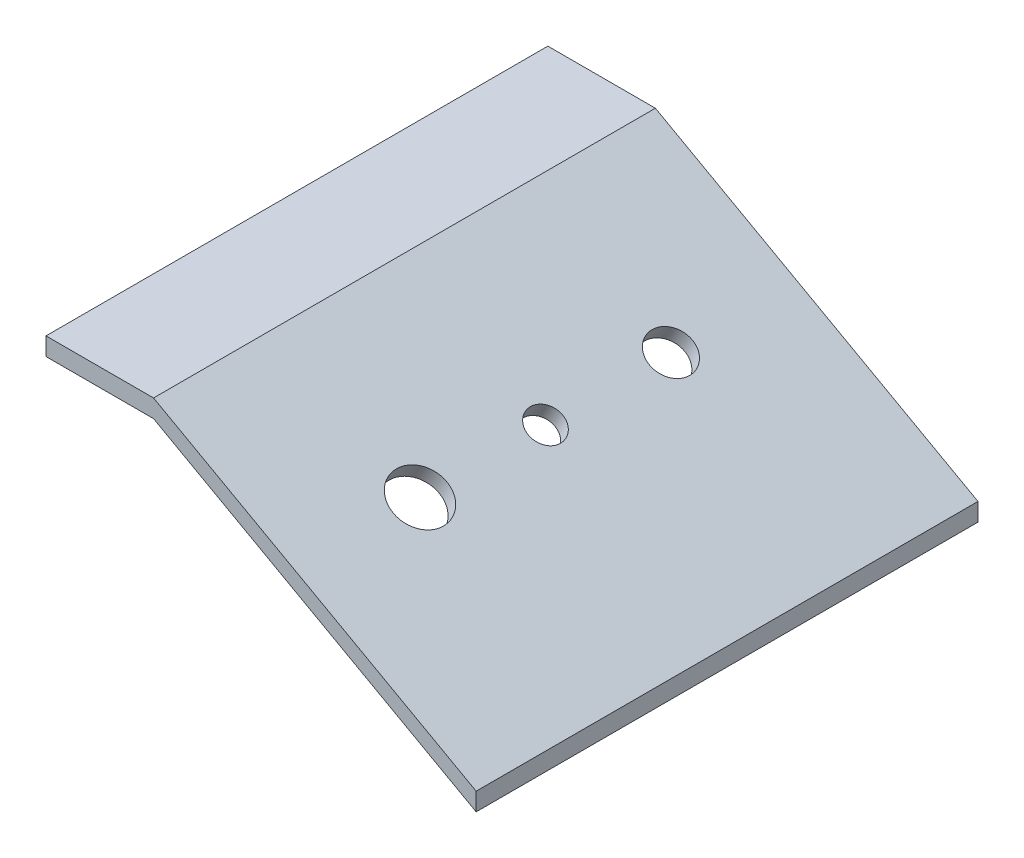
ISO-10303-21;
HEADER;
FILE_DESCRIPTION(('STEP AP214'),'2;1');
FILE_NAME('part.step','',(''),(''),'','','');
FILE_SCHEMA(('AUTOMOTIVE_DESIGN { 1 0 10303 214 1 1 1 1 }'));
ENDSEC;
DATA;
#1=APPLICATION_CONTEXT('core data for automotive mechanical design processes');
#2=APPLICATION_PROTOCOL_DEFINITION('international standard','automotive_design',2000,#1);
#3=PRODUCT_CONTEXT('',#1,'mechanical');
#4=PRODUCT('Part','Part','',(#3));
#5=PRODUCT_RELATED_PRODUCT_CATEGORY('part','',(#4));
#6=PRODUCT_DEFINITION_FORMATION('','',#4);
#7=PRODUCT_DEFINITION_CONTEXT('part definition',#1,'design');
#8=PRODUCT_DEFINITION('design','',#6,#7);
#9=PRODUCT_DEFINITION_SHAPE('','',#8);
#10=(LENGTH_UNIT() NAMED_UNIT(*) SI_UNIT(.MILLI.,.METRE.));
#11=(NAMED_UNIT(*) PLANE_ANGLE_UNIT() SI_UNIT($,.RADIAN.));
#12=(NAMED_UNIT(*) SI_UNIT($,.STERADIAN.) SOLID_ANGLE_UNIT());
#13=UNCERTAINTY_MEASURE_WITH_UNIT(LENGTH_MEASURE(1.E-05),#10,'distance_accuracy_value','');
#14=(GEOMETRIC_REPRESENTATION_CONTEXT(3) GLOBAL_UNCERTAINTY_ASSIGNED_CONTEXT((#13)) GLOBAL_UNIT_ASSIGNED_CONTEXT((#10,
#11,#12)) REPRESENTATION_CONTEXT('',''));
#15=CARTESIAN_POINT('',(0.,0.,0.));
#16=DIRECTION('',(0.,0.,1.));
#17=DIRECTION('',(1.,0.,0.));
#18=AXIS2_PLACEMENT_3D('',#15,#16,#17);
#19=CARTESIAN_POINT('',(0.,0.,152.4));
#20=DIRECTION('',(1.,0.,0.));
#21=DIRECTION('',(0.,0.,-1.));
#22=AXIS2_PLACEMENT_3D('',#19,#20,#21);
#23=PLANE('',#22);
#24=DIRECTION('',(0.,0.,-1.));
#25=VECTOR('',#24,1.);
#26=CARTESIAN_POINT('',(0.,6.35,152.4));
#27=LINE('',#26,#25);
#28=CARTESIAN_POINT('',(0.,6.35,165.1));
#29=VERTEX_POINT('',#28);
#30=CARTESIAN_POINT('',(0.,6.35,-12.7));
#31=VERTEX_POINT('',#30);
#32=EDGE_CURVE('E54',#29,#31,#27,.T.);
#33=ORIENTED_EDGE('',*,*,#32,.T.);
#34=DIRECTION('',(0.,1.,0.));
#35=VECTOR('',#34,1.);
#36=CARTESIAN_POINT('',(0.,6.35,-12.7));
#37=LINE('',#36,#35);
#38=CARTESIAN_POINT('',(0.,0.,-12.7));
#39=VERTEX_POINT('',#38);
#40=EDGE_CURVE('E84',#39,#31,#37,.T.);
#41=ORIENTED_EDGE('',*,*,#40,.F.);
#42=DIRECTION('',(0.,0.,-1.));
#43=VECTOR('',#42,1.);
#44=CARTESIAN_POINT('',(0.,0.,152.4));
#45=LINE('',#44,#43);
#46=CARTESIAN_POINT('',(0.,0.,165.1));
#47=VERTEX_POINT('',#46);
#48=EDGE_CURVE('E46',#47,#39,#45,.T.);
#49=ORIENTED_EDGE('',*,*,#48,.F.);
#50=DIRECTION('',(0.,-1.,0.));
#51=VECTOR('',#50,1.);
#52=CARTESIAN_POINT('',(0.,0.,165.1));
#53=LINE('',#52,#51);
#54=EDGE_CURVE('E85',#29,#47,#53,.T.);
#55=ORIENTED_EDGE('',*,*,#54,.F.);
#56=EDGE_LOOP('',(#33,#41,#49,#55));
#57=FACE_BOUND('',#56,.T.);
#58=ADVANCED_FACE('F32',(#57),#23,.F.);
#59=CARTESIAN_POINT('',(0.,0.,152.4));
#60=DIRECTION('',(0.,1.,0.));
#61=DIRECTION('',(0.,0.,1.));
#62=AXIS2_PLACEMENT_3D('',#59,#60,#61);
#63=PLANE('',#62);
#64=CARTESIAN_POINT('',(12.7,0.,146.05));
#65=DIRECTION('',(0.,1.,0.));
#66=DIRECTION('',(0.,0.,1.));
#67=AXIS2_PLACEMENT_3D('',#64,#65,#66);
#68=CIRCLE('',#67,3.175);
#69=CARTESIAN_POINT('',(12.7,0.,149.225));
#70=VERTEX_POINT('',#69);
#71=EDGE_CURVE('E166',#70,#70,#68,.F.);
#72=ORIENTED_EDGE('',*,*,#71,.F.);
#73=EDGE_LOOP('',(#72));
#74=FACE_BOUND('',#73,.T.);
#75=CARTESIAN_POINT('',(12.7,0.,6.34999999999999));
#76=DIRECTION('',(0.,1.,0.));
#77=DIRECTION('',(0.,0.,1.));
#78=AXIS2_PLACEMENT_3D('',#75,#76,#77);
#79=CIRCLE('',#78,3.175);
#80=CARTESIAN_POINT('',(12.7,0.,9.525));
#81=VERTEX_POINT('',#80);
#82=EDGE_CURVE('E163',#81,#81,#79,.F.);
#83=ORIENTED_EDGE('',*,*,#82,.F.);
#84=EDGE_LOOP('',(#83));
#85=FACE_BOUND('',#84,.T.);
#86=ORIENTED_EDGE('',*,*,#48,.T.);
#87=DIRECTION('',(-1.,0.,0.));
#88=VECTOR('',#87,1.);
#89=CARTESIAN_POINT('',(0.,0.,-12.7));
#90=LINE('',#89,#88);
#91=CARTESIAN_POINT('',(38.1,0.,-12.7));
#92=VERTEX_POINT('',#91);
#93=EDGE_CURVE('E101',#92,#39,#90,.T.);
#94=ORIENTED_EDGE('',*,*,#93,.F.);
#95=DIRECTION('',(0.,0.,-1.));
#96=VECTOR('',#95,1.);
#97=CARTESIAN_POINT('',(38.1,0.,152.4));
#98=LINE('',#97,#96);
#99=CARTESIAN_POINT('',(38.1,0.,165.1));
#100=VERTEX_POINT('',#99);
#101=EDGE_CURVE('E160',#100,#92,#98,.T.);
#102=ORIENTED_EDGE('',*,*,#101,.F.);
#103=DIRECTION('',(1.,0.,0.));
#104=VECTOR('',#103,1.);
#105=CARTESIAN_POINT('',(38.1,0.,165.1));
#106=LINE('',#105,#104);
#107=EDGE_CURVE('E111',#47,#100,#106,.T.);
#108=ORIENTED_EDGE('',*,*,#107,.F.);
#109=EDGE_LOOP('',(#86,#94,#102,#108));
#110=FACE_BOUND('',#109,.T.);
#111=ADVANCED_FACE('F177',(#74,#85,#110),#63,.F.);
#112=CARTESIAN_POINT('',(38.1,0.,152.4));
#113=DIRECTION('',(0.485642931178632,0.874157276121538,0.));
#114=DIRECTION('',(-0.874157276121538,0.485642931178632,0.));
#115=AXIS2_PLACEMENT_3D('',#112,#113,#114);
#116=PLANE('',#115);
#117=CARTESIAN_POINT('',(141.298202593256,-57.3323347740314,146.05));
#118=DIRECTION('',(0.485642931178632,0.874157276121538,0.));
#119=DIRECTION('',(-0.874157276121538,0.485642931178632,0.));
#120=AXIS2_PLACEMENT_3D('',#117,#118,#119);
#121=CIRCLE('',#120,3.17499999999999);
#122=CARTESIAN_POINT('',(138.522753241571,-55.7904184675392,146.05));
#123=VERTEX_POINT('',#122);
#124=EDGE_CURVE('E11',#123,#123,#121,.F.);
#125=ORIENTED_EDGE('',*,*,#124,.F.);
#126=EDGE_LOOP('',(#125));
#127=FACE_BOUND('',#126,.T.);
#128=CARTESIAN_POINT('',(141.298202593256,-57.3323347740314,6.34999999999999));
#129=DIRECTION('',(0.485642931178632,0.874157276121538,0.));
#130=DIRECTION('',(-0.874157276121538,0.485642931178632,0.));
#131=AXIS2_PLACEMENT_3D('',#128,#129,#130);
#132=CIRCLE('',#131,3.17499999999999);
#133=CARTESIAN_POINT('',(138.522753241571,-55.7904184675392,6.34999999999999));
#134=VERTEX_POINT('',#133);
#135=EDGE_CURVE('E39',#134,#134,#132,.F.);
#136=ORIENTED_EDGE('',*,*,#135,.F.);
#137=EDGE_LOOP('',(#136));
#138=FACE_BOUND('',#137,.T.);
#139=CARTESIAN_POINT('',(85.3623336133648,-26.2568520074249,120.65));
#140=DIRECTION('',(0.485642931178632,0.874157276121538,0.));
#141=DIRECTION('',(-0.874157276121538,0.485642931178632,0.));
#142=AXIS2_PLACEMENT_3D('',#139,#140,#141);
#143=CIRCLE('',#142,9.52500000000001);
#144=CARTESIAN_POINT('',(77.0359855583071,-21.6311030879484,120.65));
#145=VERTEX_POINT('',#144);
#146=EDGE_CURVE('E87',#145,#145,#143,.T.);
#147=ORIENTED_EDGE('',*,*,#146,.T.);
#148=EDGE_LOOP('',(#147));
#149=FACE_BOUND('',#148,.T.);
#150=CARTESIAN_POINT('',(85.3623336133648,-26.2568520074249,76.2));
#151=DIRECTION('',(0.485642931178632,0.874157276121538,0.));
#152=DIRECTION('',(-0.874157276121538,0.485642931178632,0.));
#153=AXIS2_PLACEMENT_3D('',#150,#151,#152);
#154=CIRCLE('',#153,6.09600000000001);
#155=CARTESIAN_POINT('',(80.0334708581279,-23.2963726989599,76.2));
#156=VERTEX_POINT('',#155);
#157=EDGE_CURVE('E150',#156,#156,#154,.T.);
#158=ORIENTED_EDGE('',*,*,#157,.T.);
#159=EDGE_LOOP('',(#158));
#160=FACE_BOUND('',#159,.T.);
#161=CARTESIAN_POINT('',(85.3623336133648,-26.2568520074249,31.75));
#162=DIRECTION('',(0.485642931178632,0.874157276121538,0.));
#163=DIRECTION('',(-0.874157276121538,0.485642931178632,0.));
#164=AXIS2_PLACEMENT_3D('',#161,#162,#163);
#165=CIRCLE('',#164,7.62);
#166=CARTESIAN_POINT('',(78.7012551693187,-22.5562528718437,31.75));
#167=VERTEX_POINT('',#166);
#168=EDGE_CURVE('E142',#167,#167,#165,.T.);
#169=ORIENTED_EDGE('',*,*,#168,.T.);
#170=EDGE_LOOP('',(#169));
#171=FACE_BOUND('',#170,.T.);
#172=ORIENTED_EDGE('',*,*,#101,.T.);
#173=DIRECTION('',(-0.874157276121538,0.485642931178632,0.));
#174=VECTOR('',#173,1.);
#175=CARTESIAN_POINT('',(38.1,0.,-12.7));
#176=LINE('',#175,#174);
#177=CARTESIAN_POINT('',(152.4,-63.5,-12.7));
#178=VERTEX_POINT('',#177);
#179=EDGE_CURVE('E108',#178,#92,#176,.T.);
#180=ORIENTED_EDGE('',*,*,#179,.F.);
#181=DIRECTION('',(0.,0.,-1.));
#182=VECTOR('',#181,1.);
#183=CARTESIAN_POINT('',(152.4,-63.5,152.4));
#184=LINE('',#183,#182);
#185=CARTESIAN_POINT('',(152.4,-63.5,165.1));
#186=VERTEX_POINT('',#185);
#187=EDGE_CURVE('E158',#186,#178,#184,.T.);
#188=ORIENTED_EDGE('',*,*,#187,.F.);
#189=DIRECTION('',(0.874157276121538,-0.485642931178632,0.));
#190=VECTOR('',#189,1.);
#191=CARTESIAN_POINT('',(152.4,-63.5,165.1));
#192=LINE('',#191,#190);
#193=EDGE_CURVE('E114',#100,#186,#192,.T.);
#194=ORIENTED_EDGE('',*,*,#193,.F.);
#195=EDGE_LOOP('',(#172,#180,#188,#194));
#196=FACE_BOUND('',#195,.T.);
#197=ADVANCED_FACE('F173',(#127,#138,#149,#160,#171,#196),#116,.F.);
#198=CARTESIAN_POINT('',(152.4,-63.5,152.4));
#199=DIRECTION('',(-1.,0.,0.));
#200=DIRECTION('',(0.,0.,1.));
#201=AXIS2_PLACEMENT_3D('',#198,#199,#200);
#202=PLANE('',#201);
#203=ORIENTED_EDGE('',*,*,#187,.T.);
#204=DIRECTION('',(0.,-1.,0.));
#205=VECTOR('',#204,1.);
#206=CARTESIAN_POINT('',(152.4,-63.5,-12.7));
#207=LINE('',#206,#205);
#208=CARTESIAN_POINT('',(152.4,-57.15,-12.7));
#209=VERTEX_POINT('',#208);
#210=EDGE_CURVE('E105',#209,#178,#207,.T.);
#211=ORIENTED_EDGE('',*,*,#210,.F.);
#212=DIRECTION('',(0.,0.,-1.));
#213=VECTOR('',#212,1.);
#214=CARTESIAN_POINT('',(152.4,-57.15,152.4));
#215=LINE('',#214,#213);
#216=CARTESIAN_POINT('',(152.4,-57.15,165.1));
#217=VERTEX_POINT('',#216);
#218=EDGE_CURVE('E156',#217,#209,#215,.T.);
#219=ORIENTED_EDGE('',*,*,#218,.F.);
#220=DIRECTION('',(0.,1.,0.));
#221=VECTOR('',#220,1.);
#222=CARTESIAN_POINT('',(152.4,-57.15,165.1));
#223=LINE('',#222,#221);
#224=EDGE_CURVE('E117',#186,#217,#223,.T.);
#225=ORIENTED_EDGE('',*,*,#224,.F.);
#226=EDGE_LOOP('',(#203,#211,#219,#225));
#227=FACE_BOUND('',#226,.T.);
#228=ADVANCED_FACE('F176',(#227),#202,.F.);
#229=CARTESIAN_POINT('',(152.4,-57.15,152.4));
#230=DIRECTION('',(-0.485642931178632,-0.874157276121538,0.));
#231=DIRECTION('',(0.874157276121538,-0.485642931178632,0.));
#232=AXIS2_PLACEMENT_3D('',#229,#230,#231);
#233=PLANE('',#232);
#234=CARTESIAN_POINT('',(88.0580883303459,-21.4044935168588,120.65));
#235=DIRECTION('',(0.485642931178632,0.874157276121538,0.));
#236=DIRECTION('',(-0.874157276121538,0.485642931178632,0.));
#237=AXIS2_PLACEMENT_3D('',#234,#235,#236);
#238=CIRCLE('',#237,9.52500000000001);
#239=CARTESIAN_POINT('',(79.7317402752882,-16.7787445973823,120.65));
#240=VERTEX_POINT('',#239);
#241=EDGE_CURVE('E139',#240,#240,#238,.T.);
#242=ORIENTED_EDGE('',*,*,#241,.F.);
#243=EDGE_LOOP('',(#242));
#244=FACE_BOUND('',#243,.T.);
#245=CARTESIAN_POINT('',(88.0580883303459,-21.4044935168588,76.2));
#246=DIRECTION('',(0.485642931178632,0.874157276121538,0.));
#247=DIRECTION('',(-0.874157276121538,0.485642931178632,0.));
#248=AXIS2_PLACEMENT_3D('',#245,#246,#247);
#249=CIRCLE('',#248,6.09600000000001);
#250=CARTESIAN_POINT('',(82.729225575109,-18.4440142083939,76.2));
#251=VERTEX_POINT('',#250);
#252=EDGE_CURVE('E143',#251,#251,#249,.T.);
#253=ORIENTED_EDGE('',*,*,#252,.F.);
#254=EDGE_LOOP('',(#253));
#255=FACE_BOUND('',#254,.T.);
#256=CARTESIAN_POINT('',(88.0580883303459,-21.4044935168588,31.75));
#257=DIRECTION('',(0.485642931178632,0.874157276121538,0.));
#258=DIRECTION('',(-0.874157276121538,0.485642931178632,0.));
#259=AXIS2_PLACEMENT_3D('',#256,#257,#258);
#260=CIRCLE('',#259,7.62);
#261=CARTESIAN_POINT('',(81.3970098862998,-17.7038943812776,31.75));
#262=VERTEX_POINT('',#261);
#263=EDGE_CURVE('E138',#262,#262,#260,.T.);
#264=ORIENTED_EDGE('',*,*,#263,.F.);
#265=EDGE_LOOP('',(#264));
#266=FACE_BOUND('',#265,.T.);
#267=ORIENTED_EDGE('',*,*,#218,.T.);
#268=DIRECTION('',(0.874157276121538,-0.485642931178632,0.));
#269=VECTOR('',#268,1.);
#270=CARTESIAN_POINT('',(152.4,-57.15,-12.7));
#271=LINE('',#270,#269);
#272=CARTESIAN_POINT('',(38.1,6.34999999999998,-12.7));
#273=VERTEX_POINT('',#272);
#274=EDGE_CURVE('E95',#273,#209,#271,.T.);
#275=ORIENTED_EDGE('',*,*,#274,.F.);
#276=DIRECTION('',(0.,0.,-1.));
#277=VECTOR('',#276,1.);
#278=CARTESIAN_POINT('',(38.1,6.34999999999998,152.4));
#279=LINE('',#278,#277);
#280=CARTESIAN_POINT('',(38.1,6.34999999999998,165.1));
#281=VERTEX_POINT('',#280);
#282=EDGE_CURVE('E86',#281,#273,#279,.T.);
#283=ORIENTED_EDGE('',*,*,#282,.F.);
#284=DIRECTION('',(-0.874157276121538,0.485642931178632,0.));
#285=VECTOR('',#284,1.);
#286=CARTESIAN_POINT('',(38.1,6.34999999999998,165.1));
#287=LINE('',#286,#285);
#288=EDGE_CURVE('E120',#217,#281,#287,.T.);
#289=ORIENTED_EDGE('',*,*,#288,.F.);
#290=EDGE_LOOP('',(#267,#275,#283,#289));
#291=FACE_BOUND('',#290,.T.);
#292=ADVANCED_FACE('F196',(#244,#255,#266,#291),#233,.F.);
#293=CARTESIAN_POINT('',(0.,6.35,152.4));
#294=DIRECTION('',(0.,-1.,0.));
#295=DIRECTION('',(1.,0.,0.));
#296=AXIS2_PLACEMENT_3D('',#293,#294,#295);
#297=PLANE('',#296);
#298=ORIENTED_EDGE('',*,*,#282,.T.);
#299=DIRECTION('',(1.,0.,0.));
#300=VECTOR('',#299,1.);
#301=CARTESIAN_POINT('',(38.1,6.34999999999998,-12.7));
#302=LINE('',#301,#300);
#303=EDGE_CURVE('E90',#31,#273,#302,.T.);
#304=ORIENTED_EDGE('',*,*,#303,.F.);
#305=ORIENTED_EDGE('',*,*,#32,.F.);
#306=DIRECTION('',(-1.,0.,0.));
#307=VECTOR('',#306,1.);
#308=CARTESIAN_POINT('',(0.,6.35,165.1));
#309=LINE('',#308,#307);
#310=EDGE_CURVE('E123',#281,#29,#309,.T.);
#311=ORIENTED_EDGE('',*,*,#310,.F.);
#312=EDGE_LOOP('',(#298,#304,#305,#311));
#313=FACE_BOUND('',#312,.T.);
#314=ADVANCED_FACE('F91',(#313),#297,.F.);
#315=CARTESIAN_POINT('',(14.0461056187224,-154.626062397781,31.75));
#316=DIRECTION('',(0.485642931178632,0.874157276121538,0.));
#317=DIRECTION('',(-0.874157276121538,0.485642931178632,0.));
#318=AXIS2_PLACEMENT_3D('',#315,#316,#317);
#319=CYLINDRICAL_SURFACE('',#318,7.62);
#320=ORIENTED_EDGE('',*,*,#263,.T.);
#321=EDGE_LOOP('',(#320));
#322=FACE_BOUND('',#321,.T.);
#323=ORIENTED_EDGE('',*,*,#168,.F.);
#324=EDGE_LOOP('',(#323));
#325=FACE_BOUND('',#324,.T.);
#326=ADVANCED_FACE('F237',(#322,#325),#319,.F.);
#327=CARTESIAN_POINT('',(14.0461056187224,-154.626062397781,76.2));
#328=DIRECTION('',(0.485642931178632,0.874157276121538,0.));
#329=DIRECTION('',(-0.874157276121538,0.485642931178632,0.));
#330=AXIS2_PLACEMENT_3D('',#327,#328,#329);
#331=CYLINDRICAL_SURFACE('',#330,6.09600000000001);
#332=ORIENTED_EDGE('',*,*,#252,.T.);
#333=EDGE_LOOP('',(#332));
#334=FACE_BOUND('',#333,.T.);
#335=ORIENTED_EDGE('',*,*,#157,.F.);
#336=EDGE_LOOP('',(#335));
#337=FACE_BOUND('',#336,.T.);
#338=ADVANCED_FACE('F229',(#334,#337),#331,.F.);
#339=CARTESIAN_POINT('',(14.0461056187224,-154.626062397781,120.65));
#340=DIRECTION('',(0.485642931178632,0.874157276121538,0.));
#341=DIRECTION('',(-0.874157276121538,0.485642931178632,0.));
#342=AXIS2_PLACEMENT_3D('',#339,#340,#341);
#343=CYLINDRICAL_SURFACE('',#342,9.52500000000001);
#344=ORIENTED_EDGE('',*,*,#241,.T.);
#345=EDGE_LOOP('',(#344));
#346=FACE_BOUND('',#345,.T.);
#347=ORIENTED_EDGE('',*,*,#146,.F.);
#348=EDGE_LOOP('',(#347));
#349=FACE_BOUND('',#348,.T.);
#350=ADVANCED_FACE('F219',(#346,#349),#343,.F.);
#351=CARTESIAN_POINT('',(12.7,-12.7,6.34999999999999));
#352=DIRECTION('',(0.,1.,0.));
#353=DIRECTION('',(0.,0.,1.));
#354=AXIS2_PLACEMENT_3D('',#351,#352,#353);
#355=CYLINDRICAL_SURFACE('',#354,3.175);
#356=CARTESIAN_POINT('',(12.7,-12.7,6.34999999999999));
#357=DIRECTION('',(0.,-1.,0.));
#358=DIRECTION('',(0.,0.,-1.));
#359=AXIS2_PLACEMENT_3D('',#356,#357,#358);
#360=CIRCLE('',#359,3.175);
#361=CARTESIAN_POINT('',(12.7,-12.7,3.17499999999999));
#362=VERTEX_POINT('',#361);
#363=EDGE_CURVE('E135',#362,#362,#360,.T.);
#364=ORIENTED_EDGE('',*,*,#363,.F.);
#365=EDGE_LOOP('',(#364));
#366=FACE_BOUND('',#365,.T.);
#367=ORIENTED_EDGE('',*,*,#82,.T.);
#368=EDGE_LOOP('',(#367));
#369=FACE_BOUND('',#368,.T.);
#370=ADVANCED_FACE('F216',(#366,#369),#355,.T.);
#371=CARTESIAN_POINT('',(12.7,-12.7,6.34999999999999));
#372=DIRECTION('',(0.,-1.,0.));
#373=DIRECTION('',(0.,0.,-1.));
#374=AXIS2_PLACEMENT_3D('',#371,#372,#373);
#375=PLANE('',#374);
#376=ORIENTED_EDGE('',*,*,#363,.T.);
#377=EDGE_LOOP('',(#376));
#378=FACE_BOUND('',#377,.T.);
#379=ADVANCED_FACE('F218',(#378),#375,.T.);
#380=CARTESIAN_POINT('',(12.7,-12.7,146.05));
#381=DIRECTION('',(0.,1.,0.));
#382=DIRECTION('',(0.,0.,1.));
#383=AXIS2_PLACEMENT_3D('',#380,#381,#382);
#384=CYLINDRICAL_SURFACE('',#383,3.175);
#385=CARTESIAN_POINT('',(12.7,-12.7,146.05));
#386=DIRECTION('',(0.,-1.,0.));
#387=DIRECTION('',(0.,0.,-1.));
#388=AXIS2_PLACEMENT_3D('',#385,#386,#387);
#389=CIRCLE('',#388,3.175);
#390=CARTESIAN_POINT('',(12.7,-12.7,142.875));
#391=VERTEX_POINT('',#390);
#392=EDGE_CURVE('E132',#391,#391,#389,.T.);
#393=ORIENTED_EDGE('',*,*,#392,.F.);
#394=EDGE_LOOP('',(#393));
#395=FACE_BOUND('',#394,.T.);
#396=ORIENTED_EDGE('',*,*,#71,.T.);
#397=EDGE_LOOP('',(#396));
#398=FACE_BOUND('',#397,.T.);
#399=ADVANCED_FACE('F226',(#395,#398),#384,.T.);
#400=CARTESIAN_POINT('',(12.7,-12.7,146.05));
#401=DIRECTION('',(0.,-1.,0.));
#402=DIRECTION('',(0.,0.,-1.));
#403=AXIS2_PLACEMENT_3D('',#400,#401,#402);
#404=PLANE('',#403);
#405=ORIENTED_EDGE('',*,*,#392,.T.);
#406=EDGE_LOOP('',(#405));
#407=FACE_BOUND('',#406,.T.);
#408=ADVANCED_FACE('F279',(#407),#404,.T.);
#409=CARTESIAN_POINT('',(135.130537367288,-68.4341321807749,6.34999999999999));
#410=DIRECTION('',(0.485642931178632,0.874157276121538,0.));
#411=DIRECTION('',(-0.874157276121538,0.485642931178632,0.));
#412=AXIS2_PLACEMENT_3D('',#409,#410,#411);
#413=CYLINDRICAL_SURFACE('',#412,3.17499999999999);
#414=CARTESIAN_POINT('',(135.130537367288,-68.4341321807749,6.34999999999999));
#415=DIRECTION('',(-0.485642931178632,-0.874157276121538,0.));
#416=DIRECTION('',(0.874157276121538,-0.485642931178632,0.));
#417=AXIS2_PLACEMENT_3D('',#414,#415,#416);
#418=CIRCLE('',#417,3.17499999999999);
#419=CARTESIAN_POINT('',(137.905986718974,-69.9760484872671,6.34999999999999));
#420=VERTEX_POINT('',#419);
#421=EDGE_CURVE('E129',#420,#420,#418,.T.);
#422=ORIENTED_EDGE('',*,*,#421,.F.);
#423=EDGE_LOOP('',(#422));
#424=FACE_BOUND('',#423,.T.);
#425=ORIENTED_EDGE('',*,*,#135,.T.);
#426=EDGE_LOOP('',(#425));
#427=FACE_BOUND('',#426,.T.);
#428=ADVANCED_FACE('F171',(#424,#427),#413,.T.);
#429=CARTESIAN_POINT('',(135.130537367288,-68.4341321807749,6.34999999999999));
#430=DIRECTION('',(-0.485642931178632,-0.874157276121538,0.));
#431=DIRECTION('',(0.874157276121538,-0.485642931178632,0.));
#432=AXIS2_PLACEMENT_3D('',#429,#430,#431);
#433=PLANE('',#432);
#434=ORIENTED_EDGE('',*,*,#421,.T.);
#435=EDGE_LOOP('',(#434));
#436=FACE_BOUND('',#435,.T.);
#437=ADVANCED_FACE('F297',(#436),#433,.T.);
#438=CARTESIAN_POINT('',(135.130537367288,-68.4341321807749,146.05));
#439=DIRECTION('',(0.485642931178632,0.874157276121538,0.));
#440=DIRECTION('',(-0.874157276121538,0.485642931178632,0.));
#441=AXIS2_PLACEMENT_3D('',#438,#439,#440);
#442=CYLINDRICAL_SURFACE('',#441,3.17499999999999);
#443=CARTESIAN_POINT('',(135.130537367288,-68.4341321807749,146.05));
#444=DIRECTION('',(-0.485642931178632,-0.874157276121538,0.));
#445=DIRECTION('',(0.874157276121538,-0.485642931178632,0.));
#446=AXIS2_PLACEMENT_3D('',#443,#444,#445);
#447=CIRCLE('',#446,3.17499999999999);
#448=CARTESIAN_POINT('',(137.905986718974,-69.9760484872671,146.05));
#449=VERTEX_POINT('',#448);
#450=EDGE_CURVE('E126',#449,#449,#447,.T.);
#451=ORIENTED_EDGE('',*,*,#450,.F.);
#452=EDGE_LOOP('',(#451));
#453=FACE_BOUND('',#452,.T.);
#454=ORIENTED_EDGE('',*,*,#124,.T.);
#455=EDGE_LOOP('',(#454));
#456=FACE_BOUND('',#455,.T.);
#457=ADVANCED_FACE('F307',(#453,#456),#442,.T.);
#458=CARTESIAN_POINT('',(135.130537367288,-68.4341321807749,146.05));
#459=DIRECTION('',(-0.485642931178632,-0.874157276121538,0.));
#460=DIRECTION('',(0.874157276121538,-0.485642931178632,0.));
#461=AXIS2_PLACEMENT_3D('',#458,#459,#460);
#462=PLANE('',#461);
#463=ORIENTED_EDGE('',*,*,#450,.T.);
#464=EDGE_LOOP('',(#463));
#465=FACE_BOUND('',#464,.T.);
#466=ADVANCED_FACE('F317',(#465),#462,.T.);
#467=CARTESIAN_POINT('',(0.,0.,165.1));
#468=DIRECTION('',(0.,0.,-1.));
#469=DIRECTION('',(-1.,0.,0.));
#470=AXIS2_PLACEMENT_3D('',#467,#468,#469);
#471=PLANE('',#470);
#472=ORIENTED_EDGE('',*,*,#107,.T.);
#473=ORIENTED_EDGE('',*,*,#193,.T.);
#474=ORIENTED_EDGE('',*,*,#224,.T.);
#475=ORIENTED_EDGE('',*,*,#288,.T.);
#476=ORIENTED_EDGE('',*,*,#310,.T.);
#477=ORIENTED_EDGE('',*,*,#54,.T.);
#478=EDGE_LOOP('',(#472,#473,#474,#475,#476,#477));
#479=FACE_BOUND('',#478,.T.);
#480=ADVANCED_FACE('F192',(#479),#471,.F.);
#481=CARTESIAN_POINT('',(0.,0.,-12.7));
#482=DIRECTION('',(0.,0.,1.));
#483=DIRECTION('',(1.,0.,0.));
#484=AXIS2_PLACEMENT_3D('',#481,#482,#483);
#485=PLANE('',#484);
#486=ORIENTED_EDGE('',*,*,#40,.T.);
#487=ORIENTED_EDGE('',*,*,#303,.T.);
#488=ORIENTED_EDGE('',*,*,#274,.T.);
#489=ORIENTED_EDGE('',*,*,#210,.T.);
#490=ORIENTED_EDGE('',*,*,#179,.T.);
#491=ORIENTED_EDGE('',*,*,#93,.T.);
#492=EDGE_LOOP('',(#486,#487,#488,#489,#490,#491));
#493=FACE_BOUND('',#492,.T.);
#494=ADVANCED_FACE('F98',(#493),#485,.F.);
#495=CLOSED_SHELL('',(#58,#111,#197,#228,#292,#314,#326,#338,#350,#370,#379,#399,#408,#428,#437,
#457,#466,#480,#494));
#496=MANIFOLD_SOLID_BREP('B2',#495);
#497=ADVANCED_BREP_SHAPE_REPRESENTATION('',(#18,#496),#14);
#498=SHAPE_DEFINITION_REPRESENTATION(#9,#497);
ENDSEC;
END-ISO-10303-21;
